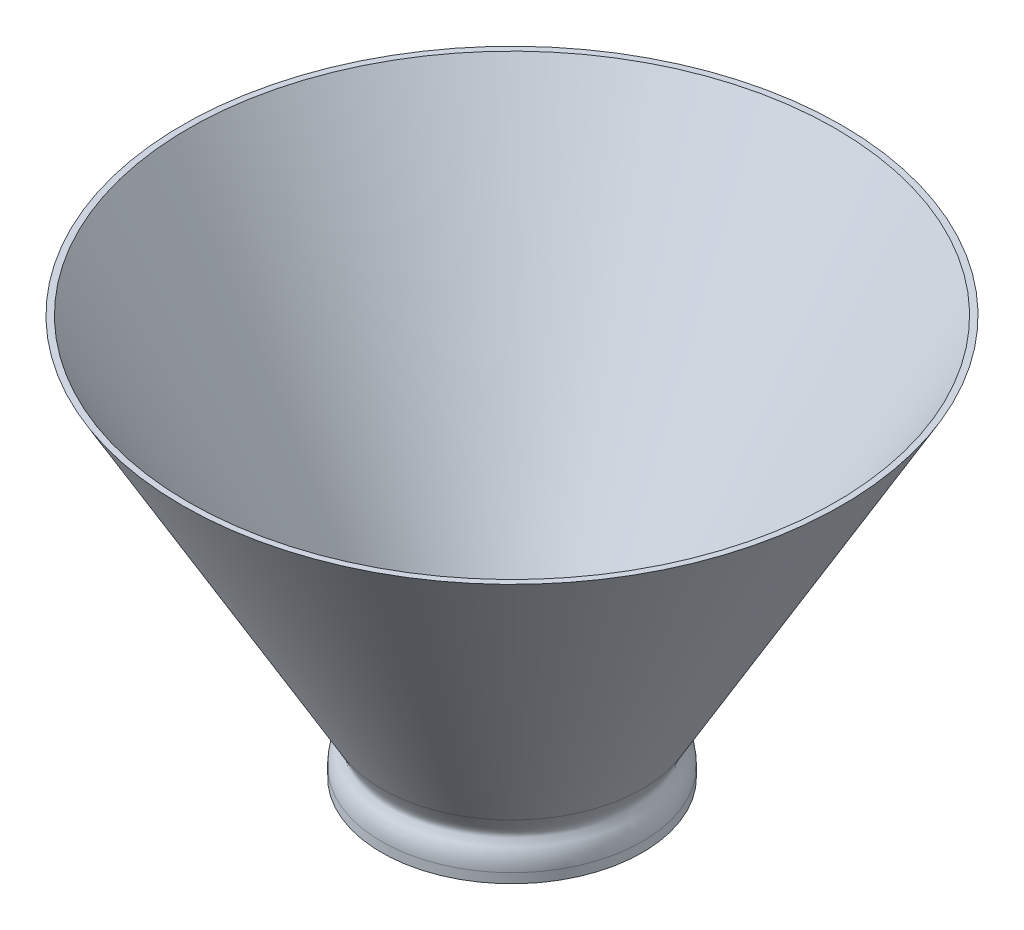
ISO-10303-21;
HEADER;
FILE_DESCRIPTION(('STEP AP214'),'2;1');
FILE_NAME('part.step','',(''),(''),'','','');
FILE_SCHEMA(('AUTOMOTIVE_DESIGN { 1 0 10303 214 1 1 1 1 }'));
ENDSEC;
DATA;
#1=APPLICATION_CONTEXT('core data for automotive mechanical design processes');
#2=APPLICATION_PROTOCOL_DEFINITION('international standard','automotive_design',2000,#1);
#3=PRODUCT_CONTEXT('',#1,'mechanical');
#4=PRODUCT('Part','Part','',(#3));
#5=PRODUCT_RELATED_PRODUCT_CATEGORY('part','',(#4));
#6=PRODUCT_DEFINITION_FORMATION('','',#4);
#7=PRODUCT_DEFINITION_CONTEXT('part definition',#1,'design');
#8=PRODUCT_DEFINITION('design','',#6,#7);
#9=PRODUCT_DEFINITION_SHAPE('','',#8);
#10=(LENGTH_UNIT() NAMED_UNIT(*) SI_UNIT(.MILLI.,.METRE.));
#11=(NAMED_UNIT(*) PLANE_ANGLE_UNIT() SI_UNIT($,.RADIAN.));
#12=(NAMED_UNIT(*) SI_UNIT($,.STERADIAN.) SOLID_ANGLE_UNIT());
#13=UNCERTAINTY_MEASURE_WITH_UNIT(LENGTH_MEASURE(1.E-05),#10,'distance_accuracy_value','');
#14=(GEOMETRIC_REPRESENTATION_CONTEXT(3) GLOBAL_UNCERTAINTY_ASSIGNED_CONTEXT((#13)) GLOBAL_UNIT_ASSIGNED_CONTEXT((#10,
#11,#12)) REPRESENTATION_CONTEXT('',''));
#15=CARTESIAN_POINT('',(0.,0.,0.));
#16=DIRECTION('',(0.,0.,1.));
#17=DIRECTION('',(1.,0.,0.));
#18=AXIS2_PLACEMENT_3D('',#15,#16,#17);
#19=CARTESIAN_POINT('',(0.,32.2039171620584,0.000157311215636921));
#20=DIRECTION('',(0.,1.,0.));
#21=DIRECTION('',(0.,0.,1.));
#22=AXIS2_PLACEMENT_3D('',#19,#20,#21);
#23=CYLINDRICAL_SURFACE('',#22,11.202328085);
#24=CARTESIAN_POINT('',(0.,33.6205187214101,0.000157311215636921));
#25=DIRECTION('',(0.,-1.,0.));
#26=DIRECTION('',(0.,0.,-1.));
#27=AXIS2_PLACEMENT_3D('',#24,#25,#26);
#28=CIRCLE('',#27,11.202328085);
#29=CARTESIAN_POINT('',(0.,33.6205187214101,-11.2021707737844));
#30=VERTEX_POINT('',#29);
#31=EDGE_CURVE('E43',#30,#30,#28,.F.);
#32=ORIENTED_EDGE('',*,*,#31,.T.);
#33=EDGE_LOOP('',(#32));
#34=FACE_BOUND('',#33,.T.);
#35=CARTESIAN_POINT('',(0.,33.4602580474018,0.000157311215636921));
#36=DIRECTION('',(0.,-1.,0.));
#37=DIRECTION('',(0.,0.,-1.));
#38=AXIS2_PLACEMENT_3D('',#35,#36,#37);
#39=CIRCLE('',#38,11.202328085);
#40=CARTESIAN_POINT('',(0.,33.4602580474018,-11.2021707737844));
#41=VERTEX_POINT('',#40);
#42=EDGE_CURVE('E39',#41,#41,#39,.F.);
#43=ORIENTED_EDGE('',*,*,#42,.F.);
#44=EDGE_LOOP('',(#43));
#45=FACE_BOUND('',#44,.T.);
#46=ADVANCED_FACE('F35',(#34,#45),#23,.F.);
#47=CARTESIAN_POINT('',(0.,74.2739813112895,0.000157311215636921));
#48=DIRECTION('',(0.,1.,0.));
#49=DIRECTION('',(0.,0.,1.));
#50=AXIS2_PLACEMENT_3D('',#47,#48,#49);
#51=CONICAL_SURFACE('',#50,34.0257628749999,0.523598775598296);
#52=CARTESIAN_POINT('',(0.,35.7144118214101,0.000157311215636921));
#53=DIRECTION('',(0.,1.,0.));
#54=DIRECTION('',(0.,0.,1.));
#55=AXIS2_PLACEMENT_3D('',#52,#53,#54);
#56=CIRCLE('',#55,11.7633850501821);
#57=CARTESIAN_POINT('',(0.,35.7144118214101,11.7635423613977));
#58=VERTEX_POINT('',#57);
#59=EDGE_CURVE('E10',#58,#58,#56,.F.);
#60=ORIENTED_EDGE('',*,*,#59,.T.);
#61=EDGE_LOOP('',(#60));
#62=FACE_BOUND('',#61,.T.);
#63=CARTESIAN_POINT('',(0.,74.2739813112895,0.000157311215636921));
#64=DIRECTION('',(0.,-1.,0.));
#65=DIRECTION('',(0.,0.,-1.));
#66=AXIS2_PLACEMENT_3D('',#63,#64,#65);
#67=CIRCLE('',#66,34.0257628749999);
#68=CARTESIAN_POINT('',(0.,74.2739813112895,-34.0256055637843));
#69=VERTEX_POINT('',#68);
#70=EDGE_CURVE('E55',#69,#69,#67,.T.);
#71=ORIENTED_EDGE('',*,*,#70,.F.);
#72=EDGE_LOOP('',(#71));
#73=FACE_BOUND('',#72,.T.);
#74=ADVANCED_FACE('F94',(#62,#73),#51,.F.);
#75=CARTESIAN_POINT('',(34.6539308049999,74.2739813112895,0.000157311215636921));
#76=DIRECTION('',(0.,1.,0.));
#77=DIRECTION('',(0.,0.,1.));
#78=AXIS2_PLACEMENT_3D('',#75,#76,#77);
#79=PLANE('',#78);
#80=ORIENTED_EDGE('',*,*,#70,.T.);
#81=EDGE_LOOP('',(#80));
#82=FACE_BOUND('',#81,.T.);
#83=CARTESIAN_POINT('',(0.,74.2739813112895,0.000157311215636921));
#84=DIRECTION('',(0.,-1.,0.));
#85=DIRECTION('',(0.,0.,-1.));
#86=AXIS2_PLACEMENT_3D('',#83,#84,#85);
#87=CIRCLE('',#86,34.6539308049999);
#88=CARTESIAN_POINT('',(0.,74.2739813112895,-34.6537734937843));
#89=VERTEX_POINT('',#88);
#90=EDGE_CURVE('E58',#89,#89,#87,.T.);
#91=ORIENTED_EDGE('',*,*,#90,.F.);
#92=EDGE_LOOP('',(#91));
#93=FACE_BOUND('',#92,.T.);
#94=ADVANCED_FACE('F90',(#82,#93),#79,.T.);
#95=CARTESIAN_POINT('',(0.,38.0066889631105,0.000157311215636921));
#96=DIRECTION('',(0.,1.,0.));
#97=DIRECTION('',(0.,0.,1.));
#98=AXIS2_PLACEMENT_3D('',#95,#96,#97);
#99=CONICAL_SURFACE('',#98,13.714999805,0.523598775598296);
#100=ORIENTED_EDGE('',*,*,#90,.T.);
#101=EDGE_LOOP('',(#100));
#102=FACE_BOUND('',#101,.T.);
#103=CARTESIAN_POINT('',(0.,38.0066889631105,0.000157311215636921));
#104=DIRECTION('',(0.,-1.,0.));
#105=DIRECTION('',(0.,0.,-1.));
#106=AXIS2_PLACEMENT_3D('',#103,#104,#105);
#107=CIRCLE('',#106,13.714999805);
#108=CARTESIAN_POINT('',(0.,38.0066889631105,-13.7148424937844));
#109=VERTEX_POINT('',#108);
#110=EDGE_CURVE('E61',#109,#109,#107,.T.);
#111=ORIENTED_EDGE('',*,*,#110,.F.);
#112=EDGE_LOOP('',(#111));
#113=FACE_BOUND('',#112,.T.);
#114=ADVANCED_FACE('F85',(#102,#113),#99,.T.);
#115=CARTESIAN_POINT('',(13.714999805,33.2089908754018,0.000157311215636921));
#116=CARTESIAN_POINT('',(13.714999805,34.8875151281565,0.000157311215636921));
#117=CARTESIAN_POINT('',(12.346756168944,35.6962621954964,0.000157311215636921));
#118=CARTESIAN_POINT('',(12.9500916773429,36.681829222886,0.000157311215636921));
#119=CARTESIAN_POINT('',(13.714999805,38.0066889631105,0.000157311215636921));
#120=B_SPLINE_CURVE_WITH_KNOTS('',3,(#115,#116,#117,#118,#119),.UNSPECIFIED.,.F.,.F.,(4,1,4),
(0.,0.536070096171614,1.),.UNSPECIFIED.);
#121=CARTESIAN_POINT('',(0.,32.2039221874018,0.000157311215636921));
#122=DIRECTION('',(0.,-1.,0.));
#123=AXIS1_PLACEMENT('',#121,#122);
#124=SURFACE_OF_REVOLUTION('',#120,#123);
#125=ORIENTED_EDGE('',*,*,#110,.T.);
#126=EDGE_LOOP('',(#125));
#127=FACE_BOUND('',#126,.T.);
#128=CARTESIAN_POINT('',(0.,33.2089908754018,0.000157311215636921));
#129=DIRECTION('',(0.,-1.,0.));
#130=DIRECTION('',(0.,0.,-1.));
#131=AXIS2_PLACEMENT_3D('',#128,#129,#130);
#132=CIRCLE('',#131,13.714999805);
#133=CARTESIAN_POINT('',(0.,33.2089908754018,-13.7148424937844));
#134=VERTEX_POINT('',#133);
#135=EDGE_CURVE('E64',#134,#134,#132,.T.);
#136=ORIENTED_EDGE('',*,*,#135,.F.);
#137=EDGE_LOOP('',(#136));
#138=FACE_BOUND('',#137,.T.);
#139=ADVANCED_FACE('F80',(#127,#138),#124,.F.);
#140=CARTESIAN_POINT('',(0.,32.2039221874018,0.000157311215636921));
#141=DIRECTION('',(0.,-1.,0.));
#142=DIRECTION('',(0.,0.,-1.));
#143=AXIS2_PLACEMENT_3D('',#140,#141,#142);
#144=CYLINDRICAL_SURFACE('',#143,13.714999805);
#145=ORIENTED_EDGE('',*,*,#135,.T.);
#146=EDGE_LOOP('',(#145));
#147=FACE_BOUND('',#146,.T.);
#148=CARTESIAN_POINT('',(0.,32.2039221874018,0.000157311215636921));
#149=DIRECTION('',(0.,-1.,0.));
#150=DIRECTION('',(0.,0.,-1.));
#151=AXIS2_PLACEMENT_3D('',#148,#149,#150);
#152=CIRCLE('',#151,13.714999805);
#153=CARTESIAN_POINT('',(0.,32.2039221874018,-13.7148424937844));
#154=VERTEX_POINT('',#153);
#155=EDGE_CURVE('E67',#154,#154,#152,.T.);
#156=ORIENTED_EDGE('',*,*,#155,.F.);
#157=EDGE_LOOP('',(#156));
#158=FACE_BOUND('',#157,.T.);
#159=ADVANCED_FACE('F84',(#147,#158),#144,.T.);
#160=CARTESIAN_POINT('',(13.086831875,32.2039221874018,0.000157311215636921));
#161=DIRECTION('',(0.,-1.,0.));
#162=DIRECTION('',(0.,0.,-1.));
#163=AXIS2_PLACEMENT_3D('',#160,#161,#162);
#164=PLANE('',#163);
#165=ORIENTED_EDGE('',*,*,#155,.T.);
#166=EDGE_LOOP('',(#165));
#167=FACE_BOUND('',#166,.T.);
#168=CARTESIAN_POINT('',(0.,32.2039221874018,0.000157311215636921));
#169=DIRECTION('',(0.,-1.,0.));
#170=DIRECTION('',(0.,0.,-1.));
#171=AXIS2_PLACEMENT_3D('',#168,#169,#170);
#172=CIRCLE('',#171,13.086831875);
#173=CARTESIAN_POINT('',(0.,32.2039221874018,-13.0866745637844));
#174=VERTEX_POINT('',#173);
#175=EDGE_CURVE('E70',#174,#174,#172,.T.);
#176=ORIENTED_EDGE('',*,*,#175,.F.);
#177=EDGE_LOOP('',(#176));
#178=FACE_BOUND('',#177,.T.);
#179=ADVANCED_FACE('F119',(#167,#178),#164,.T.);
#180=CARTESIAN_POINT('',(0.,32.2039221874018,0.000157311215636921));
#181=DIRECTION('',(0.,-1.,0.));
#182=DIRECTION('',(0.,0.,-1.));
#183=AXIS2_PLACEMENT_3D('',#180,#181,#182);
#184=CYLINDRICAL_SURFACE('',#183,13.086831875);
#185=CARTESIAN_POINT('',(0.,32.8320901174018,0.000157311215636921));
#186=DIRECTION('',(0.,-1.,0.));
#187=DIRECTION('',(0.,0.,-1.));
#188=AXIS2_PLACEMENT_3D('',#185,#186,#187);
#189=CIRCLE('',#188,13.086831875);
#190=CARTESIAN_POINT('',(0.,32.8320901174018,-13.0866745637844));
#191=VERTEX_POINT('',#190);
#192=EDGE_CURVE('E47',#191,#191,#189,.F.);
#193=ORIENTED_EDGE('',*,*,#192,.T.);
#194=EDGE_LOOP('',(#193));
#195=FACE_BOUND('',#194,.T.);
#196=ORIENTED_EDGE('',*,*,#175,.T.);
#197=EDGE_LOOP('',(#196));
#198=FACE_BOUND('',#197,.T.);
#199=ADVANCED_FACE('F106',(#195,#198),#184,.F.);
#200=CARTESIAN_POINT('',(11.30702274,33.4602580474018,0.000157311215636921));
#201=DIRECTION('',(0.,-1.,0.));
#202=DIRECTION('',(0.,0.,-1.));
#203=AXIS2_PLACEMENT_3D('',#200,#201,#202);
#204=PLANE('',#203);
#205=CARTESIAN_POINT('',(0.,33.4602580474018,0.000157311215636921));
#206=DIRECTION('',(0.,-1.,0.));
#207=DIRECTION('',(0.,0.,-1.));
#208=AXIS2_PLACEMENT_3D('',#205,#206,#207);
#209=CIRCLE('',#208,12.458663945);
#210=CARTESIAN_POINT('',(0.,33.4602580474018,-12.4585066337844));
#211=VERTEX_POINT('',#210);
#212=EDGE_CURVE('E52',#211,#211,#209,.T.);
#213=ORIENTED_EDGE('',*,*,#212,.T.);
#214=EDGE_LOOP('',(#213));
#215=FACE_BOUND('',#214,.T.);
#216=ORIENTED_EDGE('',*,*,#42,.T.);
#217=EDGE_LOOP('',(#216));
#218=FACE_BOUND('',#217,.T.);
#219=ADVANCED_FACE('F99',(#215,#218),#204,.T.);
#220=CARTESIAN_POINT('',(0.,32.8320901174018,0.000157311215636921));
#221=DIRECTION('',(0.,-1.,0.));
#222=DIRECTION('',(0.,0.,-1.));
#223=AXIS2_PLACEMENT_3D('',#220,#221,#222);
#224=TOROIDAL_SURFACE('',#223,12.458663945,0.62816793);
#225=ORIENTED_EDGE('',*,*,#192,.F.);
#226=EDGE_LOOP('',(#225));
#227=FACE_BOUND('',#226,.T.);
#228=ORIENTED_EDGE('',*,*,#212,.F.);
#229=EDGE_LOOP('',(#228));
#230=FACE_BOUND('',#229,.T.);
#231=ADVANCED_FACE('F97',(#227,#230),#224,.F.);
#232=CARTESIAN_POINT('',(0.,33.6205187214101,0.000157311215636921));
#233=DIRECTION('',(0.,-1.,0.));
#234=DIRECTION('',(0.,0.,-1.));
#235=AXIS2_PLACEMENT_3D('',#232,#233,#234);
#236=TOROIDAL_SURFACE('',#235,15.390114285,4.1877862);
#237=ORIENTED_EDGE('',*,*,#59,.F.);
#238=EDGE_LOOP('',(#237));
#239=FACE_BOUND('',#238,.T.);
#240=ORIENTED_EDGE('',*,*,#31,.F.);
#241=EDGE_LOOP('',(#240));
#242=FACE_BOUND('',#241,.T.);
#243=ADVANCED_FACE('F37',(#239,#242),#236,.T.);
#244=CLOSED_SHELL('',(#46,#74,#94,#114,#139,#159,#179,#199,#219,#231,#243));
#245=MANIFOLD_SOLID_BREP('B2',#244);
#246=ADVANCED_BREP_SHAPE_REPRESENTATION('',(#18,#245),#14);
#247=SHAPE_DEFINITION_REPRESENTATION(#9,#246);
ENDSEC;
END-ISO-10303-21;
